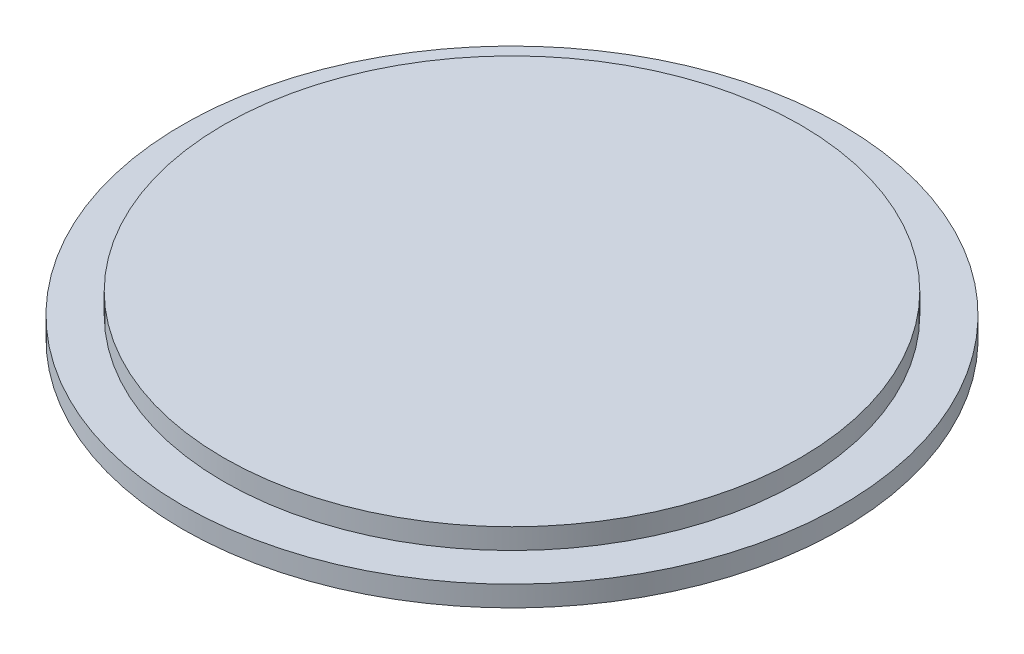
ISO-10303-21;
HEADER;
FILE_DESCRIPTION(('STEP AP214'),'2;1');
FILE_NAME('part.step','',(''),(''),'','','');
FILE_SCHEMA(('AUTOMOTIVE_DESIGN { 1 0 10303 214 1 1 1 1 }'));
ENDSEC;
DATA;
#1=APPLICATION_CONTEXT('core data for automotive mechanical design processes');
#2=APPLICATION_PROTOCOL_DEFINITION('international standard','automotive_design',2000,#1);
#3=PRODUCT_CONTEXT('',#1,'mechanical');
#4=PRODUCT('Part','Part','',(#3));
#5=PRODUCT_RELATED_PRODUCT_CATEGORY('part','',(#4));
#6=PRODUCT_DEFINITION_FORMATION('','',#4);
#7=PRODUCT_DEFINITION_CONTEXT('part definition',#1,'design');
#8=PRODUCT_DEFINITION('design','',#6,#7);
#9=PRODUCT_DEFINITION_SHAPE('','',#8);
#10=(LENGTH_UNIT() NAMED_UNIT(*) SI_UNIT(.MILLI.,.METRE.));
#11=(NAMED_UNIT(*) PLANE_ANGLE_UNIT() SI_UNIT($,.RADIAN.));
#12=(NAMED_UNIT(*) SI_UNIT($,.STERADIAN.) SOLID_ANGLE_UNIT());
#13=UNCERTAINTY_MEASURE_WITH_UNIT(LENGTH_MEASURE(1.E-05),#10,'distance_accuracy_value','');
#14=(GEOMETRIC_REPRESENTATION_CONTEXT(3) GLOBAL_UNCERTAINTY_ASSIGNED_CONTEXT((#13)) GLOBAL_UNIT_ASSIGNED_CONTEXT((#10,
#11,#12)) REPRESENTATION_CONTEXT('',''));
#15=CARTESIAN_POINT('',(0.,0.,0.));
#16=DIRECTION('',(0.,0.,1.));
#17=DIRECTION('',(1.,0.,0.));
#18=AXIS2_PLACEMENT_3D('',#15,#16,#17);
#19=CARTESIAN_POINT('',(16.,0.,0.));
#20=DIRECTION('',(0.,-1.,0.));
#21=DIRECTION('',(0.,0.,-1.));
#22=AXIS2_PLACEMENT_3D('',#19,#20,#21);
#23=PLANE('',#22);
#24=CARTESIAN_POINT('',(0.,0.,0.));
#25=DIRECTION('',(0.,-1.,0.));
#26=DIRECTION('',(0.,0.,-1.));
#27=AXIS2_PLACEMENT_3D('',#24,#25,#26);
#28=CIRCLE('',#27,16.);
#29=CARTESIAN_POINT('',(0.,0.,-16.));
#30=VERTEX_POINT('',#29);
#31=EDGE_CURVE('E47',#30,#30,#28,.T.);
#32=ORIENTED_EDGE('',*,*,#31,.T.);
#33=EDGE_LOOP('',(#32));
#34=FACE_BOUND('',#33,.T.);
#35=ADVANCED_FACE('F33',(#34),#23,.T.);
#36=CARTESIAN_POINT('',(0.,2.,0.));
#37=DIRECTION('',(0.,1.,0.));
#38=DIRECTION('',(0.,0.,1.));
#39=AXIS2_PLACEMENT_3D('',#36,#37,#38);
#40=PLANE('',#39);
#41=CARTESIAN_POINT('',(0.,2.,0.));
#42=DIRECTION('',(0.,-1.,0.));
#43=DIRECTION('',(0.,0.,-1.));
#44=AXIS2_PLACEMENT_3D('',#41,#42,#43);
#45=CIRCLE('',#44,14.);
#46=CARTESIAN_POINT('',(0.,2.,-14.));
#47=VERTEX_POINT('',#46);
#48=EDGE_CURVE('E10',#47,#47,#45,.T.);
#49=ORIENTED_EDGE('',*,*,#48,.F.);
#50=EDGE_LOOP('',(#49));
#51=FACE_BOUND('',#50,.T.);
#52=ADVANCED_FACE('F65',(#51),#40,.T.);
#53=CARTESIAN_POINT('',(0.,0.,0.));
#54=DIRECTION('',(0.,-1.,0.));
#55=DIRECTION('',(0.,0.,-1.));
#56=AXIS2_PLACEMENT_3D('',#53,#54,#55);
#57=CYLINDRICAL_SURFACE('',#56,14.);
#58=ORIENTED_EDGE('',*,*,#48,.T.);
#59=EDGE_LOOP('',(#58));
#60=FACE_BOUND('',#59,.T.);
#61=CARTESIAN_POINT('',(0.,1.,0.));
#62=DIRECTION('',(0.,-1.,0.));
#63=DIRECTION('',(0.,0.,-1.));
#64=AXIS2_PLACEMENT_3D('',#61,#62,#63);
#65=CIRCLE('',#64,14.);
#66=CARTESIAN_POINT('',(0.,1.,-14.));
#67=VERTEX_POINT('',#66);
#68=EDGE_CURVE('E39',#67,#67,#65,.T.);
#69=ORIENTED_EDGE('',*,*,#68,.F.);
#70=EDGE_LOOP('',(#69));
#71=FACE_BOUND('',#70,.T.);
#72=ADVANCED_FACE('F62',(#60,#71),#57,.T.);
#73=CARTESIAN_POINT('',(14.,1.,0.));
#74=DIRECTION('',(0.,1.,0.));
#75=DIRECTION('',(0.,0.,1.));
#76=AXIS2_PLACEMENT_3D('',#73,#74,#75);
#77=PLANE('',#76);
#78=ORIENTED_EDGE('',*,*,#68,.T.);
#79=EDGE_LOOP('',(#78));
#80=FACE_BOUND('',#79,.T.);
#81=CARTESIAN_POINT('',(0.,1.,0.));
#82=DIRECTION('',(0.,-1.,0.));
#83=DIRECTION('',(0.,0.,-1.));
#84=AXIS2_PLACEMENT_3D('',#81,#82,#83);
#85=CIRCLE('',#84,16.);
#86=CARTESIAN_POINT('',(0.,1.,-16.));
#87=VERTEX_POINT('',#86);
#88=EDGE_CURVE('E43',#87,#87,#85,.T.);
#89=ORIENTED_EDGE('',*,*,#88,.F.);
#90=EDGE_LOOP('',(#89));
#91=FACE_BOUND('',#90,.T.);
#92=ADVANCED_FACE('F56',(#80,#91),#77,.T.);
#93=CARTESIAN_POINT('',(0.,0.,0.));
#94=DIRECTION('',(0.,-1.,0.));
#95=DIRECTION('',(0.,0.,-1.));
#96=AXIS2_PLACEMENT_3D('',#93,#94,#95);
#97=CYLINDRICAL_SURFACE('',#96,16.);
#98=ORIENTED_EDGE('',*,*,#88,.T.);
#99=EDGE_LOOP('',(#98));
#100=FACE_BOUND('',#99,.T.);
#101=ORIENTED_EDGE('',*,*,#31,.F.);
#102=EDGE_LOOP('',(#101));
#103=FACE_BOUND('',#102,.T.);
#104=ADVANCED_FACE('F54',(#100,#103),#97,.T.);
#105=CLOSED_SHELL('',(#35,#52,#72,#92,#104));
#106=MANIFOLD_SOLID_BREP('B2',#105);
#107=ADVANCED_BREP_SHAPE_REPRESENTATION('',(#18,#106),#14);
#108=SHAPE_DEFINITION_REPRESENTATION(#9,#107);
ENDSEC;
END-ISO-10303-21;
